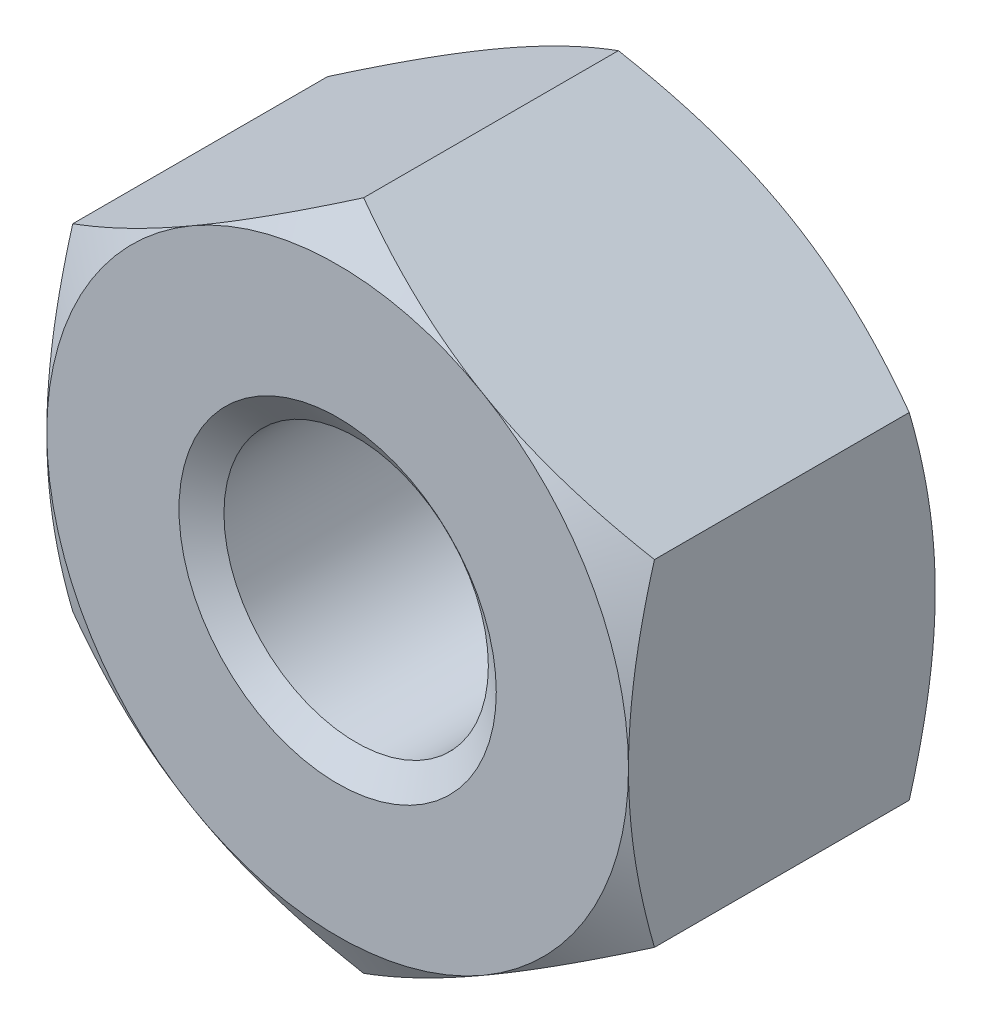
ISO-10303-21;
HEADER;
FILE_DESCRIPTION(('STEP AP214'),'2;1');
FILE_NAME('part.step','',(''),(''),'','','');
FILE_SCHEMA(('AUTOMOTIVE_DESIGN { 1 0 10303 214 1 1 1 1 }'));
ENDSEC;
DATA;
#1=APPLICATION_CONTEXT('core data for automotive mechanical design processes');
#2=APPLICATION_PROTOCOL_DEFINITION('international standard','automotive_design',2000,#1);
#3=PRODUCT_CONTEXT('',#1,'mechanical');
#4=PRODUCT('Part','Part','',(#3));
#5=PRODUCT_RELATED_PRODUCT_CATEGORY('part','',(#4));
#6=PRODUCT_DEFINITION_FORMATION('','',#4);
#7=PRODUCT_DEFINITION_CONTEXT('part definition',#1,'design');
#8=PRODUCT_DEFINITION('design','',#6,#7);
#9=PRODUCT_DEFINITION_SHAPE('','',#8);
#10=(LENGTH_UNIT() NAMED_UNIT(*) SI_UNIT(.MILLI.,.METRE.));
#11=(NAMED_UNIT(*) PLANE_ANGLE_UNIT() SI_UNIT($,.RADIAN.));
#12=(NAMED_UNIT(*) SI_UNIT($,.STERADIAN.) SOLID_ANGLE_UNIT());
#13=UNCERTAINTY_MEASURE_WITH_UNIT(LENGTH_MEASURE(1.E-05),#10,'distance_accuracy_value','');
#14=(GEOMETRIC_REPRESENTATION_CONTEXT(3) GLOBAL_UNCERTAINTY_ASSIGNED_CONTEXT((#13)) GLOBAL_UNIT_ASSIGNED_CONTEXT((#10,
#11,#12)) REPRESENTATION_CONTEXT('',''));
#15=CARTESIAN_POINT('',(0.,0.,0.));
#16=DIRECTION('',(0.,0.,1.));
#17=DIRECTION('',(1.,0.,0.));
#18=AXIS2_PLACEMENT_3D('',#15,#16,#17);
#19=CARTESIAN_POINT('',(0.,0.,-2.9));
#20=DIRECTION('',(0.,0.,1.));
#21=DIRECTION('',(1.,0.,0.));
#22=AXIS2_PLACEMENT_3D('',#19,#20,#21);
#23=CYLINDRICAL_SURFACE('',#22,1.25);
#24=CARTESIAN_POINT('',(0.,0.,-0.175051884552436));
#25=DIRECTION('',(0.,0.,1.));
#26=DIRECTION('',(1.,0.,0.));
#27=AXIS2_PLACEMENT_3D('',#24,#25,#26);
#28=CIRCLE('',#27,1.25);
#29=CARTESIAN_POINT('',(1.25,0.,-0.175051884552436));
#30=VERTEX_POINT('',#29);
#31=EDGE_CURVE('E176',#30,#30,#28,.F.);
#32=ORIENTED_EDGE('',*,*,#31,.F.);
#33=EDGE_LOOP('',(#32));
#34=FACE_BOUND('',#33,.T.);
#35=CARTESIAN_POINT('',(0.,0.,-2.69954811544757));
#36=DIRECTION('',(0.,0.,-1.));
#37=DIRECTION('',(-1.,0.,0.));
#38=AXIS2_PLACEMENT_3D('',#35,#36,#37);
#39=CIRCLE('',#38,1.25);
#40=CARTESIAN_POINT('',(-1.25,0.,-2.69954811544757));
#41=VERTEX_POINT('',#40);
#42=EDGE_CURVE('E41',#41,#41,#39,.F.);
#43=ORIENTED_EDGE('',*,*,#42,.F.);
#44=EDGE_LOOP('',(#43));
#45=FACE_BOUND('',#44,.T.);
#46=ADVANCED_FACE('F36',(#34,#45),#23,.F.);
#47=CARTESIAN_POINT('',(0.,3.17542648054296,-2.9));
#48=DIRECTION('',(-0.500000000000008,0.866025403784434,0.));
#49=DIRECTION('',(-0.866025403784434,-0.500000000000008,0.));
#50=AXIS2_PLACEMENT_3D('',#47,#48,#49);
#51=PLANE('',#50);
#52=DIRECTION('',(0.,0.,1.));
#53=VECTOR('',#52,1.);
#54=CARTESIAN_POINT('',(-2.75,1.58771324027145,-2.9));
#55=LINE('',#54,#53);
#56=CARTESIAN_POINT('',(-2.75,1.58771324027151,-2.65437990693813));
#57=VERTEX_POINT('',#56);
#58=CARTESIAN_POINT('',(-2.75,1.58771324027145,-0.245620093061857));
#59=VERTEX_POINT('',#58);
#60=EDGE_CURVE('E166',#57,#59,#55,.T.);
#61=ORIENTED_EDGE('',*,*,#60,.T.);
#62=CARTESIAN_POINT('',(-2.7502,1.58759777021761,-0.245686763364755));
#63=CARTESIAN_POINT('',(-2.62935077934009,1.65737010029697,-0.205387662249258));
#64=CARTESIAN_POINT('',(-2.50745839737737,1.72774469983531,-0.168736902597657));
#65=CARTESIAN_POINT('',(-2.26156287327211,1.86971254687001,-0.104762182969796));
#66=CARTESIAN_POINT('',(-2.13755536142615,1.94130831721582,-0.0774608556744926));
#67=CARTESIAN_POINT('',(-1.89107720202406,2.08361254889598,-0.0349617452941124));
#68=CARTESIAN_POINT('',(-1.76864448141259,2.15429911309863,-0.0194811186224536));
#69=CARTESIAN_POINT('',(-1.52320285763109,2.29600490065922,-0.000999397369936881));
#70=CARTESIAN_POINT('',(-1.4001948467671,2.36702360884403,0.00201700053740344));
#71=CARTESIAN_POINT('',(-1.17034121338921,2.49972966594897,-0.00425314542854458));
#72=CARTESIAN_POINT('',(-1.06346120874599,2.56143686540072,-0.012000154276701));
#73=CARTESIAN_POINT('',(-0.850397532665256,2.68444923614047,-0.036555181064355));
#74=CARTESIAN_POINT('',(-0.744214598351115,2.74575398185008,-0.0533715896505715));
#75=CARTESIAN_POINT('',(-0.530711510606819,2.86902004703207,-0.0954119223459598));
#76=CARTESIAN_POINT('',(-0.423418383857147,2.93096576264319,-0.120814080687235));
#77=CARTESIAN_POINT('',(-0.210432520715949,3.05393320806135,-0.178467225839989));
#78=CARTESIAN_POINT('',(-0.104737054973347,3.11495651365997,-0.210704663298991));
#79=CARTESIAN_POINT('',(0.000200000000001419,3.1755419505968,-0.245686763364771));
#80=B_SPLINE_CURVE_WITH_KNOTS('',3,(#62,#63,#64,#65,#66,#67,#68,#69,#70,#71,#72,#73,#74,#75,#76,
#77,#78,#79),.UNSPECIFIED.,.F.,.F.,(4,2,2,2,2,2,2,2,4),(0.,0.435912828725888,0.872873557116331,
1.29901931904671,1.72464171213573,2.09526089052938,2.46622354066375,2.84541551798559,
3.22386274754526),.UNSPECIFIED.);
#81=CARTESIAN_POINT('',(-1.37500000000002,2.3815698604072,0.));
#82=VERTEX_POINT('',#81);
#83=EDGE_CURVE('E135',#59,#82,#80,.T.);
#84=ORIENTED_EDGE('',*,*,#83,.T.);
#85=CARTESIAN_POINT('',(0.,3.17542648054296,-0.245620093061873));
#86=VERTEX_POINT('',#85);
#87=EDGE_CURVE('E55',#82,#86,#80,.T.);
#88=ORIENTED_EDGE('',*,*,#87,.T.);
#89=DIRECTION('',(0.,0.,1.));
#90=VECTOR('',#89,1.);
#91=CARTESIAN_POINT('',(0.,3.17542648054296,-2.9));
#92=LINE('',#91,#90);
#93=CARTESIAN_POINT('',(0.,3.17542648054296,-2.65437990693813));
#94=VERTEX_POINT('',#93);
#95=EDGE_CURVE('E151',#94,#86,#92,.T.);
#96=ORIENTED_EDGE('',*,*,#95,.F.);
#97=CARTESIAN_POINT('',(-2.7502,1.58759777021761,-2.65431323663524));
#98=CARTESIAN_POINT('',(-2.62935077934009,1.65737010029697,-2.69461233775074));
#99=CARTESIAN_POINT('',(-2.50745839737737,1.72774469983531,-2.73126309740234));
#100=CARTESIAN_POINT('',(-2.26156287327211,1.86971254687001,-2.7952378170302));
#101=CARTESIAN_POINT('',(-2.13755536142615,1.94130831721582,-2.82253914432551));
#102=CARTESIAN_POINT('',(-1.89107720202406,2.08361254889598,-2.86503825470589));
#103=CARTESIAN_POINT('',(-1.76864448141259,2.15429911309863,-2.88051888137755));
#104=CARTESIAN_POINT('',(-1.52320285763109,2.29600490065922,-2.89900060263006));
#105=CARTESIAN_POINT('',(-1.4001948467671,2.36702360884403,-2.9020170005374));
#106=CARTESIAN_POINT('',(-1.17034121338921,2.49972966594897,-2.89574685457146));
#107=CARTESIAN_POINT('',(-1.06346120874599,2.56143686540072,-2.8879998457233));
#108=CARTESIAN_POINT('',(-0.850397532665256,2.68444923614047,-2.86344481893564));
#109=CARTESIAN_POINT('',(-0.744214598351115,2.74575398185008,-2.84662841034943));
#110=CARTESIAN_POINT('',(-0.530711510606819,2.86902004703207,-2.80458807765404));
#111=CARTESIAN_POINT('',(-0.423418383857147,2.93096576264319,-2.77918591931276));
#112=CARTESIAN_POINT('',(-0.210432520715949,3.05393320806135,-2.72153277416001));
#113=CARTESIAN_POINT('',(-0.104737054973347,3.11495651365997,-2.68929533670101));
#114=CARTESIAN_POINT('',(0.000200000000001414,3.1755419505968,-2.65431323663523));
#115=B_SPLINE_CURVE_WITH_KNOTS('',3,(#97,#98,#99,#100,#101,#102,#103,#104,#105,#106,#107,#108,
#109,#110,#111,#112,#113,#114),.UNSPECIFIED.,.F.,.F.,(4,2,2,2,2,2,2,2,4),(0.,0.435912828725888,
0.872873557116332,1.29901931904671,1.72464171213573,2.09526089052938,2.46622354066375,
2.84541551798559,3.22386274754526),.UNSPECIFIED.);
#116=CARTESIAN_POINT('',(-1.37500000000002,2.3815698604072,-2.9));
#117=VERTEX_POINT('',#116);
#118=EDGE_CURVE('E169',#117,#94,#115,.T.);
#119=ORIENTED_EDGE('',*,*,#118,.F.);
#120=EDGE_CURVE('E268',#57,#117,#115,.T.);
#121=ORIENTED_EDGE('',*,*,#120,.F.);
#122=EDGE_LOOP('',(#61,#84,#88,#96,#119,#121));
#123=FACE_BOUND('',#122,.T.);
#124=ADVANCED_FACE('F38',(#123),#51,.T.);
#125=CARTESIAN_POINT('',(2.75,1.58771324027146,-2.9));
#126=DIRECTION('',(0.500000000000008,0.866025403784434,0.));
#127=DIRECTION('',(-0.866025403784434,0.500000000000008,0.));
#128=AXIS2_PLACEMENT_3D('',#125,#126,#127);
#129=PLANE('',#128);
#130=ORIENTED_EDGE('',*,*,#95,.T.);
#131=CARTESIAN_POINT('',(-0.00019999999999841,3.1755419505968,-0.245686763364771));
#132=CARTESIAN_POINT('',(0.120649220659908,3.10576962051744,-0.205387662249272));
#133=CARTESIAN_POINT('',(0.242541602622636,3.03539502097909,-0.16873690259767));
#134=CARTESIAN_POINT('',(0.488437126727895,2.8934271739444,-0.104762182969806));
#135=CARTESIAN_POINT('',(0.612444638573857,2.82183140359859,-0.0774608556745017));
#136=CARTESIAN_POINT('',(0.858922797975946,2.67952717191843,-0.0349617452941191));
#137=CARTESIAN_POINT('',(0.981355518587419,2.60884060771578,-0.0194811186224591));
#138=CARTESIAN_POINT('',(1.22679714236892,2.46713482015519,-0.000999397369940009));
#139=CARTESIAN_POINT('',(1.34980515323291,2.39611611197038,0.00201700053740151));
#140=CARTESIAN_POINT('',(1.5796587866108,2.26341005486544,-0.00425314542854448));
#141=CARTESIAN_POINT('',(1.68653879125402,2.20170285541368,-0.0120001542766998));
#142=CARTESIAN_POINT('',(1.89960246733475,2.07869048467394,-0.0365551810643516));
#143=CARTESIAN_POINT('',(2.00578540164889,2.01738573896433,-0.0533715896505668));
#144=CARTESIAN_POINT('',(2.21928848939318,1.89411967378234,-0.0954119223459524));
#145=CARTESIAN_POINT('',(2.32658161614286,1.83217395817122,-0.120814080687227));
#146=CARTESIAN_POINT('',(2.53956747928405,1.70920651275306,-0.178467225839978));
#147=CARTESIAN_POINT('',(2.64526294502665,1.64818320715445,-0.210704663298978));
#148=CARTESIAN_POINT('',(2.7502,1.58759777021762,-0.245686763364757));
#149=B_SPLINE_CURVE_WITH_KNOTS('',3,(#131,#132,#133,#134,#135,#136,#137,#138,#139,#140,#141,
#142,#143,#144,#145,#146,#147,#148),.UNSPECIFIED.,.F.,.F.,(4,2,2,2,2,2,2,2,4),(0.,
0.435912828725892,0.872873557116339,1.29901931904672,1.72464171213575,2.09526089052939,
2.46622354066376,2.84541551798559,3.22386274754526),.UNSPECIFIED.);
#150=CARTESIAN_POINT('',(1.37500000000002,2.3815698604072,0.));
#151=VERTEX_POINT('',#150);
#152=EDGE_CURVE('E145',#86,#151,#149,.T.);
#153=ORIENTED_EDGE('',*,*,#152,.T.);
#154=CARTESIAN_POINT('',(2.75,1.58771324027151,-0.245620093061873));
#155=VERTEX_POINT('',#154);
#156=EDGE_CURVE('E62',#151,#155,#149,.T.);
#157=ORIENTED_EDGE('',*,*,#156,.T.);
#158=DIRECTION('',(0.,0.,1.));
#159=VECTOR('',#158,1.);
#160=CARTESIAN_POINT('',(2.75,1.58771324027146,-2.9));
#161=LINE('',#160,#159);
#162=CARTESIAN_POINT('',(2.75,1.58771324027151,-2.65437990693813));
#163=VERTEX_POINT('',#162);
#164=EDGE_CURVE('E144',#163,#155,#161,.T.);
#165=ORIENTED_EDGE('',*,*,#164,.F.);
#166=CARTESIAN_POINT('',(-0.00019999999999841,3.1755419505968,-2.65431323663523));
#167=CARTESIAN_POINT('',(0.120649220659908,3.10576962051744,-2.69461233775073));
#168=CARTESIAN_POINT('',(0.242541602622636,3.03539502097909,-2.73126309740233));
#169=CARTESIAN_POINT('',(0.488437126727895,2.8934271739444,-2.79523781703019));
#170=CARTESIAN_POINT('',(0.612444638573858,2.82183140359859,-2.8225391443255));
#171=CARTESIAN_POINT('',(0.858922797975946,2.67952717191843,-2.86503825470588));
#172=CARTESIAN_POINT('',(0.98135551858742,2.60884060771578,-2.88051888137754));
#173=CARTESIAN_POINT('',(1.22679714236892,2.46713482015519,-2.89900060263006));
#174=CARTESIAN_POINT('',(1.34980515323291,2.39611611197038,-2.9020170005374));
#175=CARTESIAN_POINT('',(1.5796587866108,2.26341005486544,-2.89574685457146));
#176=CARTESIAN_POINT('',(1.68653879125402,2.20170285541368,-2.8879998457233));
#177=CARTESIAN_POINT('',(1.89960246733475,2.07869048467394,-2.86344481893565));
#178=CARTESIAN_POINT('',(2.00578540164889,2.01738573896433,-2.84662841034943));
#179=CARTESIAN_POINT('',(2.21928848939318,1.89411967378234,-2.80458807765405));
#180=CARTESIAN_POINT('',(2.32658161614285,1.83217395817122,-2.77918591931277));
#181=CARTESIAN_POINT('',(2.53956747928405,1.70920651275306,-2.72153277416002));
#182=CARTESIAN_POINT('',(2.64526294502665,1.64818320715445,-2.68929533670102));
#183=CARTESIAN_POINT('',(2.7502,1.58759777021762,-2.65431323663524));
#184=B_SPLINE_CURVE_WITH_KNOTS('',3,(#166,#167,#168,#169,#170,#171,#172,#173,#174,#175,#176,
#177,#178,#179,#180,#181,#182,#183),.UNSPECIFIED.,.F.,.F.,(4,2,2,2,2,2,2,2,4),(0.,
0.435912828725892,0.872873557116339,1.29901931904672,1.72464171213575,2.09526089052939,
2.46622354066376,2.84541551798558,3.22386274754526),.UNSPECIFIED.);
#185=CARTESIAN_POINT('',(1.37500000000002,2.3815698604072,-2.9));
#186=VERTEX_POINT('',#185);
#187=EDGE_CURVE('E261',#186,#163,#184,.T.);
#188=ORIENTED_EDGE('',*,*,#187,.F.);
#189=EDGE_CURVE('E267',#94,#186,#184,.T.);
#190=ORIENTED_EDGE('',*,*,#189,.F.);
#191=EDGE_LOOP('',(#130,#153,#157,#165,#188,#190));
#192=FACE_BOUND('',#191,.T.);
#193=ADVANCED_FACE('F142',(#192),#129,.T.);
#194=CARTESIAN_POINT('',(2.75,1.58771324027146,-2.9));
#195=DIRECTION('',(-1.,0.,0.));
#196=DIRECTION('',(0.,0.,1.));
#197=AXIS2_PLACEMENT_3D('',#194,#195,#196);
#198=PLANE('',#197);
#199=CARTESIAN_POINT('',(2.75,-4.21084949309679,-1.31594843960296));
#200=CARTESIAN_POINT('',(2.75,-4.09010894214093,-1.25759993615226));
#201=CARTESIAN_POINT('',(2.75,-3.96908292065512,-1.19983146511761));
#202=CARTESIAN_POINT('',(2.75,-3.72630558284847,-1.08578603842307));
#203=CARTESIAN_POINT('',(2.75,-3.60455414536203,-1.02950934100249));
#204=CARTESIAN_POINT('',(2.75,-3.35951393034357,-0.918482443352775));
#205=CARTESIAN_POINT('',(2.75,-3.23622034236439,-0.863742821605855));
#206=CARTESIAN_POINT('',(2.75,-2.98861980138746,-0.75661477747647));
#207=CARTESIAN_POINT('',(2.75,-2.86431290161185,-0.704226232536779));
#208=CARTESIAN_POINT('',(2.75,-2.61294485887175,-0.601803572146137));
#209=CARTESIAN_POINT('',(2.75,-2.48586863815657,-0.551806257898406));
#210=CARTESIAN_POINT('',(2.75,-2.23021732171543,-0.455727408784612));
#211=CARTESIAN_POINT('',(2.75,-2.10164206103366,-0.409646309576982));
#212=CARTESIAN_POINT('',(2.75,-1.8430521879947,-0.32263807704624));
#213=CARTESIAN_POINT('',(2.75,-1.71304130052586,-0.281699986413896));
#214=CARTESIAN_POINT('',(2.75,-1.4511712506215,-0.206307307624354));
#215=CARTESIAN_POINT('',(2.75,-1.31931268690205,-0.171850669152772));
#216=CARTESIAN_POINT('',(2.75,-1.05365722480015,-0.111093671530907));
#217=CARTESIAN_POINT('',(2.75,-0.919859820217614,-0.084795484095124));
#218=CARTESIAN_POINT('',(2.75,-0.650651874037403,-0.0421260371966123));
#219=CARTESIAN_POINT('',(2.75,-0.515241331013616,-0.0257547865105436));
#220=CARTESIAN_POINT('',(2.75,-0.244373242869231,-0.00438749654023665));
#221=CARTESIAN_POINT('',(2.75,-0.108921526377152,0.000680556773217393));
#222=CARTESIAN_POINT('',(2.75,0.161887058855116,-0.000827795632669437));
#223=CARTESIAN_POINT('',(2.75,0.297243943089623,-0.00740117868555063));
#224=CARTESIAN_POINT('',(2.75,0.528385436717524,-0.02810413004684));
#225=CARTESIAN_POINT('',(2.75,0.62442505013748,-0.039537641030184));
#226=CARTESIAN_POINT('',(2.75,0.81576239981152,-0.0675217196133457));
#227=CARTESIAN_POINT('',(2.75,0.911060016631941,-0.0840730942276763));
#228=CARTESIAN_POINT('',(2.75,1.19576218748914,-0.140535361278277));
#229=CARTESIAN_POINT('',(2.75,1.38383224738493,-0.187239859417285));
#230=CARTESIAN_POINT('',(2.75,1.66525048947482,-0.267792497030568));
#231=CARTESIAN_POINT('',(2.75,1.76006556248554,-0.296803334995489));
#232=CARTESIAN_POINT('',(2.75,1.94870609382211,-0.357695648906575));
#233=CARTESIAN_POINT('',(2.75,2.04253218553692,-0.38957514487849));
#234=CARTESIAN_POINT('',(2.75,2.2288024035498,-0.455541418186434));
#235=CARTESIAN_POINT('',(2.75,2.32125133588447,-0.489614761455518));
#236=CARTESIAN_POINT('',(2.75,2.50543192042624,-0.559761368231093));
#237=CARTESIAN_POINT('',(2.75,2.59716326539574,-0.595835440037301));
#238=CARTESIAN_POINT('',(2.75,2.68856293053341,-0.632712441997467));
#239=B_SPLINE_CURVE_WITH_KNOTS('',3,(#199,#200,#201,#202,#203,#204,#205,#206,#207,#208,#209,
#210,#211,#212,#213,#214,#215,#216,#217,#218,#219,#220,#221,#222,#223,#224,#225,#226,#227,#228,
#229,#230,#231,#232,#233,#234,#235,#236,#237,#238),.UNSPECIFIED.,.F.,.F.,(4,2,2,2,2,2,2,2,2,2,2,
2,2,2,2,2,2,2,2,4),(0.,0.402305607365937,0.804680408536998,1.20935783819118,1.61401414820819,
2.0236383818577,2.43330812457349,2.84208969479601,3.25074173456637,3.65950246109145,
4.06826354901185,4.47441284024652,4.88045669141174,5.17046846817547,5.46052599902453,
6.04107275309883,6.33851131304661,6.63574613017454,6.93130791005791,7.22698998004821),.UNSPECIFIED.);
#240=CARTESIAN_POINT('',(2.75000000000001,-1.58771324027149,-0.245620093061873));
#241=VERTEX_POINT('',#240);
#242=CARTESIAN_POINT('',(2.75,0.,0.));
#243=VERTEX_POINT('',#242);
#244=EDGE_CURVE('E137',#241,#243,#239,.T.);
#245=ORIENTED_EDGE('',*,*,#244,.F.);
#246=DIRECTION('',(0.,0.,1.));
#247=VECTOR('',#246,1.);
#248=CARTESIAN_POINT('',(2.75,-1.5877132402715,-2.9));
#249=LINE('',#248,#247);
#250=CARTESIAN_POINT('',(2.75000000000001,-1.58771324027149,-2.65437990693813));
#251=VERTEX_POINT('',#250);
#252=EDGE_CURVE('E152',#251,#241,#249,.T.);
#253=ORIENTED_EDGE('',*,*,#252,.F.);
#254=CARTESIAN_POINT('',(2.75,-4.21084949309679,-1.58405156039704));
#255=CARTESIAN_POINT('',(2.75,-4.09010894214093,-1.64240006384774));
#256=CARTESIAN_POINT('',(2.75,-3.96908292065512,-1.70016853488239));
#257=CARTESIAN_POINT('',(2.75,-3.72630558284846,-1.81421396157693));
#258=CARTESIAN_POINT('',(2.75,-3.60455414536203,-1.87049065899751));
#259=CARTESIAN_POINT('',(2.75,-3.35951393034357,-1.98151755664723));
#260=CARTESIAN_POINT('',(2.75,-3.23622034236439,-2.03625717839415));
#261=CARTESIAN_POINT('',(2.75,-2.98861980138746,-2.14338522252353));
#262=CARTESIAN_POINT('',(2.75,-2.86431290161185,-2.19577376746322));
#263=CARTESIAN_POINT('',(2.75,-2.61294485887175,-2.29819642785386));
#264=CARTESIAN_POINT('',(2.75,-2.48586863815657,-2.34819374210159));
#265=CARTESIAN_POINT('',(2.75,-2.23021732171543,-2.44427259121539));
#266=CARTESIAN_POINT('',(2.75,-2.10164206103366,-2.49035369042302));
#267=CARTESIAN_POINT('',(2.75,-1.8430521879947,-2.57736192295376));
#268=CARTESIAN_POINT('',(2.75,-1.71304130052586,-2.6183000135861));
#269=CARTESIAN_POINT('',(2.75,-1.4511712506215,-2.69369269237565));
#270=CARTESIAN_POINT('',(2.75,-1.31931268690205,-2.72814933084723));
#271=CARTESIAN_POINT('',(2.75,-1.05365722480015,-2.78890632846909));
#272=CARTESIAN_POINT('',(2.75,-0.919859820217613,-2.81520451590488));
#273=CARTESIAN_POINT('',(2.75,-0.650651874037402,-2.85787396280339));
#274=CARTESIAN_POINT('',(2.75,-0.515241331013616,-2.87424521348946));
#275=CARTESIAN_POINT('',(2.75,-0.244373242869231,-2.89561250345976));
#276=CARTESIAN_POINT('',(2.75,-0.108921526377152,-2.90068055677322));
#277=CARTESIAN_POINT('',(2.75,0.161887058855116,-2.89917220436733));
#278=CARTESIAN_POINT('',(2.75,0.297243943089623,-2.89259882131445));
#279=CARTESIAN_POINT('',(2.75,0.528385436717523,-2.87189586995316));
#280=CARTESIAN_POINT('',(2.75,0.62442505013748,-2.86046235896982));
#281=CARTESIAN_POINT('',(2.75,0.81576239981152,-2.83247828038665));
#282=CARTESIAN_POINT('',(2.75,0.911060016631941,-2.81592690577232));
#283=CARTESIAN_POINT('',(2.75,1.19576218748914,-2.75946463872172));
#284=CARTESIAN_POINT('',(2.75,1.38383224738493,-2.71276014058271));
#285=CARTESIAN_POINT('',(2.75,1.66525048947482,-2.63220750296943));
#286=CARTESIAN_POINT('',(2.75,1.76006556248554,-2.60319666500451));
#287=CARTESIAN_POINT('',(2.75,1.94870609382211,-2.54230435109342));
#288=CARTESIAN_POINT('',(2.75,2.04253218553692,-2.51042485512151));
#289=CARTESIAN_POINT('',(2.75,2.2288024035498,-2.44445858181357));
#290=CARTESIAN_POINT('',(2.75,2.32125133588447,-2.41038523854448));
#291=CARTESIAN_POINT('',(2.75,2.50543192042624,-2.34023863176891));
#292=CARTESIAN_POINT('',(2.75,2.59716326539574,-2.3041645599627));
#293=CARTESIAN_POINT('',(2.75,2.68856293053341,-2.26728755800253));
#294=B_SPLINE_CURVE_WITH_KNOTS('',3,(#254,#255,#256,#257,#258,#259,#260,#261,#262,#263,#264,
#265,#266,#267,#268,#269,#270,#271,#272,#273,#274,#275,#276,#277,#278,#279,#280,#281,#282,#283,
#284,#285,#286,#287,#288,#289,#290,#291,#292,#293),.UNSPECIFIED.,.F.,.F.,(4,2,2,2,2,2,2,2,2,2,2,
2,2,2,2,2,2,2,2,4),(0.,0.402305607365938,0.804680408536999,1.20935783819118,1.61401414820819,
2.0236383818577,2.43330812457349,2.84208969479601,3.25074173456637,3.65950246109145,
4.06826354901185,4.47441284024652,4.88045669141174,5.17046846817547,5.46052599902453,
6.04107275309883,6.33851131304661,6.63574613017454,6.93130791005791,7.22698998004821),.UNSPECIFIED.);
#295=CARTESIAN_POINT('',(2.75,0.,-2.9));
#296=VERTEX_POINT('',#295);
#297=EDGE_CURVE('E275',#251,#296,#294,.T.);
#298=ORIENTED_EDGE('',*,*,#297,.T.);
#299=EDGE_CURVE('E150',#296,#163,#294,.T.);
#300=ORIENTED_EDGE('',*,*,#299,.T.);
#301=ORIENTED_EDGE('',*,*,#164,.T.);
#302=EDGE_CURVE('E127',#243,#155,#239,.T.);
#303=ORIENTED_EDGE('',*,*,#302,.F.);
#304=EDGE_LOOP('',(#245,#253,#298,#300,#301,#303));
#305=FACE_BOUND('',#304,.T.);
#306=ADVANCED_FACE('F148',(#305),#198,.F.);
#307=CARTESIAN_POINT('',(0.,-3.175426480543,-2.9));
#308=DIRECTION('',(0.500000000000007,-0.866025403784435,0.));
#309=DIRECTION('',(0.866025403784435,0.500000000000007,0.));
#310=AXIS2_PLACEMENT_3D('',#307,#308,#309);
#311=PLANE('',#310);
#312=ORIENTED_EDGE('',*,*,#252,.T.);
#313=CARTESIAN_POINT('',(2.7502,-1.58759777021766,-0.245686763364769));
#314=CARTESIAN_POINT('',(2.62935077934009,-1.65737010029702,-0.205387662249272));
#315=CARTESIAN_POINT('',(2.50745839737736,-1.72774469983536,-0.168736902597671));
#316=CARTESIAN_POINT('',(2.2615628732721,-1.86971254687006,-0.104762182969811));
#317=CARTESIAN_POINT('',(2.13755536142614,-1.94130831721586,-0.0774608556745088));
#318=CARTESIAN_POINT('',(1.89107720202405,-2.08361254889603,-0.0349617452941302));
#319=CARTESIAN_POINT('',(1.76864448141258,-2.15429911309868,-0.0194811186224723));
#320=CARTESIAN_POINT('',(1.52320285763108,-2.29600490065927,-0.000999397369957487));
#321=CARTESIAN_POINT('',(1.40019484676708,-2.36702360884408,0.00201700053738184));
#322=CARTESIAN_POINT('',(1.1703412133892,-2.49972966594902,-0.00425314542856775));
#323=CARTESIAN_POINT('',(1.06346120874597,-2.56143686540077,-0.0120001542767246));
#324=CARTESIAN_POINT('',(0.850397532665247,-2.68444923614051,-0.0365551810643794));
#325=CARTESIAN_POINT('',(0.744214598351108,-2.74575398185013,-0.0533715896505962));
#326=CARTESIAN_POINT('',(0.530711510606814,-2.86902004703211,-0.0954119223459845));
#327=CARTESIAN_POINT('',(0.423418383857143,-2.93096576264323,-0.12081408068726));
#328=CARTESIAN_POINT('',(0.210432520715948,-3.05393320806139,-0.178467225840013));
#329=CARTESIAN_POINT('',(0.104737054973348,-3.11495651366001,-0.210704663299014));
#330=CARTESIAN_POINT('',(-0.000199999999998988,-3.17554195059683,-0.245686763364793));
#331=B_SPLINE_CURVE_WITH_KNOTS('',3,(#313,#314,#315,#316,#317,#318,#319,#320,#321,#322,#323,
#324,#325,#326,#327,#328,#329,#330),.UNSPECIFIED.,.F.,.F.,(4,2,2,2,2,2,2,2,4),(0.,
0.435912828725891,0.872873557116337,1.29901931904672,1.72464171213575,2.09526089052939,
2.46622354066375,2.84541551798558,3.22386274754526),.UNSPECIFIED.);
#332=CARTESIAN_POINT('',(1.37500000000002,-2.3815698604072,0.));
#333=VERTEX_POINT('',#332);
#334=EDGE_CURVE('E373',#241,#333,#331,.T.);
#335=ORIENTED_EDGE('',*,*,#334,.T.);
#336=CARTESIAN_POINT('',(0.,-3.17542648054296,-0.245620093061873));
#337=VERTEX_POINT('',#336);
#338=EDGE_CURVE('E229',#333,#337,#331,.T.);
#339=ORIENTED_EDGE('',*,*,#338,.T.);
#340=DIRECTION('',(0.,0.,1.));
#341=VECTOR('',#340,1.);
#342=CARTESIAN_POINT('',(0.,-3.175426480543,-2.9));
#343=LINE('',#342,#341);
#344=CARTESIAN_POINT('',(0.,-3.17542648054296,-2.65437990693813));
#345=VERTEX_POINT('',#344);
#346=EDGE_CURVE('E157',#345,#337,#343,.T.);
#347=ORIENTED_EDGE('',*,*,#346,.F.);
#348=CARTESIAN_POINT('',(2.7502,-1.58759777021766,-2.65431323663523));
#349=CARTESIAN_POINT('',(2.62935077934009,-1.65737010029702,-2.69461233775073));
#350=CARTESIAN_POINT('',(2.50745839737736,-1.72774469983536,-2.73126309740233));
#351=CARTESIAN_POINT('',(2.2615628732721,-1.86971254687006,-2.79523781703019));
#352=CARTESIAN_POINT('',(2.13755536142614,-1.94130831721586,-2.82253914432549));
#353=CARTESIAN_POINT('',(1.89107720202405,-2.08361254889603,-2.86503825470587));
#354=CARTESIAN_POINT('',(1.76864448141258,-2.15429911309868,-2.88051888137753));
#355=CARTESIAN_POINT('',(1.52320285763108,-2.29600490065927,-2.89900060263004));
#356=CARTESIAN_POINT('',(1.40019484676708,-2.36702360884408,-2.90201700053738));
#357=CARTESIAN_POINT('',(1.1703412133892,-2.49972966594902,-2.89574685457143));
#358=CARTESIAN_POINT('',(1.06346120874597,-2.56143686540077,-2.88799984572328));
#359=CARTESIAN_POINT('',(0.850397532665247,-2.68444923614051,-2.86344481893562));
#360=CARTESIAN_POINT('',(0.744214598351108,-2.74575398185013,-2.8466284103494));
#361=CARTESIAN_POINT('',(0.530711510606815,-2.86902004703211,-2.80458807765402));
#362=CARTESIAN_POINT('',(0.423418383857144,-2.93096576264323,-2.77918591931274));
#363=CARTESIAN_POINT('',(0.210432520715949,-3.05393320806139,-2.72153277415999));
#364=CARTESIAN_POINT('',(0.104737054973348,-3.11495651366,-2.68929533670099));
#365=CARTESIAN_POINT('',(-0.000199999999998861,-3.17554195059683,-2.65431323663521));
#366=B_SPLINE_CURVE_WITH_KNOTS('',3,(#348,#349,#350,#351,#352,#353,#354,#355,#356,#357,#358,
#359,#360,#361,#362,#363,#364,#365),.UNSPECIFIED.,.F.,.F.,(4,2,2,2,2,2,2,2,4),(0.,
0.435912828725891,0.872873557116338,1.29901931904672,1.72464171213575,2.09526089052939,
2.46622354066375,2.84541551798558,3.22386274754526),.UNSPECIFIED.);
#367=CARTESIAN_POINT('',(1.37500000000002,-2.3815698604072,-2.9));
#368=VERTEX_POINT('',#367);
#369=EDGE_CURVE('E282',#368,#345,#366,.T.);
#370=ORIENTED_EDGE('',*,*,#369,.F.);
#371=EDGE_CURVE('E281',#251,#368,#366,.T.);
#372=ORIENTED_EDGE('',*,*,#371,.F.);
#373=EDGE_LOOP('',(#312,#335,#339,#347,#370,#372));
#374=FACE_BOUND('',#373,.T.);
#375=ADVANCED_FACE('F294',(#374),#311,.T.);
#376=CARTESIAN_POINT('',(-2.75,-1.5877132402715,-2.9));
#377=DIRECTION('',(-0.500000000000006,-0.866025403784435,0.));
#378=DIRECTION('',(0.866025403784435,-0.500000000000006,0.));
#379=AXIS2_PLACEMENT_3D('',#376,#377,#378);
#380=PLANE('',#379);
#381=ORIENTED_EDGE('',*,*,#346,.T.);
#382=CARTESIAN_POINT('',(0.000200000000001002,-3.17554195059683,-0.245686763364793));
#383=CARTESIAN_POINT('',(-0.120649220659907,-3.10576962051748,-0.205387662249294));
#384=CARTESIAN_POINT('',(-0.242541602622636,-3.03539502097913,-0.168736902597691));
#385=CARTESIAN_POINT('',(-0.488437126727898,-2.89342717394443,-0.104762182969827));
#386=CARTESIAN_POINT('',(-0.612444638573863,-2.82183140359863,-0.0774608556745226));
#387=CARTESIAN_POINT('',(-0.858922797975955,-2.67952717191846,-0.0349617452941396));
#388=CARTESIAN_POINT('',(-0.98135551858743,-2.60884060771581,-0.0194811186224794));
#389=CARTESIAN_POINT('',(-1.22679714236893,-2.46713482015522,-0.000999397369960387));
#390=CARTESIAN_POINT('',(-1.34980515323293,-2.39611611197041,0.00201700053738092));
#391=CARTESIAN_POINT('',(-1.57965878661081,-2.26341005486547,-0.00425314542856523));
#392=CARTESIAN_POINT('',(-1.68653879125404,-2.20170285541372,-0.0120001542767203));
#393=CARTESIAN_POINT('',(-1.89960246733476,-2.07869048467398,-0.0365551810643714));
#394=CARTESIAN_POINT('',(-2.0057854016489,-2.01738573896436,-0.0533715896505862));
#395=CARTESIAN_POINT('',(-2.21928848939319,-1.89411967378238,-0.0954119223459706));
#396=CARTESIAN_POINT('',(-2.32658161614286,-1.83217395817126,-0.120814080687244));
#397=CARTESIAN_POINT('',(-2.53956747928405,-1.70920651275311,-0.178467225839993));
#398=CARTESIAN_POINT('',(-2.64526294502665,-1.64818320715449,-0.210704663298993));
#399=CARTESIAN_POINT('',(-2.7502,-1.58759777021766,-0.24568676336477));
#400=B_SPLINE_CURVE_WITH_KNOTS('',3,(#382,#383,#384,#385,#386,#387,#388,#389,#390,#391,#392,
#393,#394,#395,#396,#397,#398,#399),.UNSPECIFIED.,.F.,.F.,(4,2,2,2,2,2,2,2,4),(0.,
0.435912828725896,0.872873557116349,1.29901931904674,1.72464171213577,2.0952608905294,
2.46622354066377,2.84541551798559,3.22386274754526),.UNSPECIFIED.);
#401=CARTESIAN_POINT('',(-1.37500000000002,-2.3815698604072,0.));
#402=VERTEX_POINT('',#401);
#403=EDGE_CURVE('E370',#337,#402,#400,.T.);
#404=ORIENTED_EDGE('',*,*,#403,.T.);
#405=CARTESIAN_POINT('',(-2.75,-1.58771324027151,-0.245620093061873));
#406=VERTEX_POINT('',#405);
#407=EDGE_CURVE('E202',#402,#406,#400,.T.);
#408=ORIENTED_EDGE('',*,*,#407,.T.);
#409=DIRECTION('',(0.,0.,1.));
#410=VECTOR('',#409,1.);
#411=CARTESIAN_POINT('',(-2.75,-1.5877132402715,-2.9));
#412=LINE('',#411,#410);
#413=CARTESIAN_POINT('',(-2.75,-1.58771324027151,-2.65437990693813));
#414=VERTEX_POINT('',#413);
#415=EDGE_CURVE('E163',#414,#406,#412,.T.);
#416=ORIENTED_EDGE('',*,*,#415,.F.);
#417=CARTESIAN_POINT('',(0.000200000000001002,-3.17554195059683,-2.65431323663521));
#418=CARTESIAN_POINT('',(-0.120649220659907,-3.10576962051748,-2.69461233775071));
#419=CARTESIAN_POINT('',(-0.242541602622636,-3.03539502097913,-2.73126309740231));
#420=CARTESIAN_POINT('',(-0.488437126727899,-2.89342717394443,-2.79523781703017));
#421=CARTESIAN_POINT('',(-0.612444638573863,-2.82183140359863,-2.82253914432548));
#422=CARTESIAN_POINT('',(-0.858922797975955,-2.67952717191846,-2.86503825470586));
#423=CARTESIAN_POINT('',(-0.98135551858743,-2.60884060771581,-2.88051888137752));
#424=CARTESIAN_POINT('',(-1.22679714236893,-2.46713482015522,-2.89900060263004));
#425=CARTESIAN_POINT('',(-1.34980515323293,-2.39611611197041,-2.90201700053738));
#426=CARTESIAN_POINT('',(-1.57965878661081,-2.26341005486547,-2.89574685457143));
#427=CARTESIAN_POINT('',(-1.68653879125404,-2.20170285541372,-2.88799984572328));
#428=CARTESIAN_POINT('',(-1.89960246733476,-2.07869048467398,-2.86344481893563));
#429=CARTESIAN_POINT('',(-2.0057854016489,-2.01738573896436,-2.84662841034941));
#430=CARTESIAN_POINT('',(-2.21928848939319,-1.89411967378238,-2.80458807765403));
#431=CARTESIAN_POINT('',(-2.32658161614286,-1.83217395817126,-2.77918591931276));
#432=CARTESIAN_POINT('',(-2.53956747928405,-1.70920651275311,-2.72153277416001));
#433=CARTESIAN_POINT('',(-2.64526294502665,-1.64818320715449,-2.68929533670101));
#434=CARTESIAN_POINT('',(-2.7502,-1.58759777021766,-2.65431323663523));
#435=B_SPLINE_CURVE_WITH_KNOTS('',3,(#417,#418,#419,#420,#421,#422,#423,#424,#425,#426,#427,
#428,#429,#430,#431,#432,#433,#434),.UNSPECIFIED.,.F.,.F.,(4,2,2,2,2,2,2,2,4),(0.,
0.435912828725897,0.872873557116349,1.29901931904674,1.72464171213577,2.0952608905294,
2.46622354066377,2.84541551798559,3.22386274754526),.UNSPECIFIED.);
#436=CARTESIAN_POINT('',(-1.37500000000002,-2.3815698604072,-2.9));
#437=VERTEX_POINT('',#436);
#438=EDGE_CURVE('E289',#437,#414,#435,.T.);
#439=ORIENTED_EDGE('',*,*,#438,.F.);
#440=EDGE_CURVE('E288',#345,#437,#435,.T.);
#441=ORIENTED_EDGE('',*,*,#440,.F.);
#442=EDGE_LOOP('',(#381,#404,#408,#416,#439,#441));
#443=FACE_BOUND('',#442,.T.);
#444=ADVANCED_FACE('F297',(#443),#380,.T.);
#445=CARTESIAN_POINT('',(-2.75,1.58771324027145,-2.9));
#446=DIRECTION('',(-1.,0.,0.));
#447=DIRECTION('',(0.,0.,1.));
#448=AXIS2_PLACEMENT_3D('',#445,#446,#447);
#449=PLANE('',#448);
#450=ORIENTED_EDGE('',*,*,#415,.T.);
#451=CARTESIAN_POINT('',(-2.75,-4.21084949309679,-1.31594843960296));
#452=CARTESIAN_POINT('',(-2.75,-4.09010894214093,-1.25759993615227));
#453=CARTESIAN_POINT('',(-2.75,-3.96908292065512,-1.19983146511761));
#454=CARTESIAN_POINT('',(-2.75,-3.72630558284847,-1.08578603842307));
#455=CARTESIAN_POINT('',(-2.75,-3.60455414536203,-1.02950934100249));
#456=CARTESIAN_POINT('',(-2.75,-3.35951393034358,-0.918482443352777));
#457=CARTESIAN_POINT('',(-2.75,-3.2362203423644,-0.863742821605856));
#458=CARTESIAN_POINT('',(-2.75,-2.98861980138747,-0.756614777476471));
#459=CARTESIAN_POINT('',(-2.75,-2.86431290161185,-0.70422623253678));
#460=CARTESIAN_POINT('',(-2.75,-2.61294485887175,-0.601803572146139));
#461=CARTESIAN_POINT('',(-2.75,-2.48586863815657,-0.551806257898408));
#462=CARTESIAN_POINT('',(-2.75,-2.23021732171544,-0.455727408784613));
#463=CARTESIAN_POINT('',(-2.75,-2.10164206103366,-0.409646309576983));
#464=CARTESIAN_POINT('',(-2.75,-1.8430521879947,-0.322638077046241));
#465=CARTESIAN_POINT('',(-2.75,-1.71304130052586,-0.281699986413897));
#466=CARTESIAN_POINT('',(-2.75,-1.4511712506215,-0.206307307624355));
#467=CARTESIAN_POINT('',(-2.75,-1.31931268690205,-0.171850669152773));
#468=CARTESIAN_POINT('',(-2.75,-1.05365722480015,-0.111093671530908));
#469=CARTESIAN_POINT('',(-2.75,-0.919859820217618,-0.0847954840951249));
#470=CARTESIAN_POINT('',(-2.75,-0.650651874037407,-0.0421260371966128));
#471=CARTESIAN_POINT('',(-2.75,-0.51524133101362,-0.0257547865105438));
#472=CARTESIAN_POINT('',(-2.75,-0.244373242869235,-0.00438749654023648));
#473=CARTESIAN_POINT('',(-2.75,-0.108921526377157,0.00068055677321763));
#474=CARTESIAN_POINT('',(-2.75,0.161887058855112,-0.000827795632669175));
#475=CARTESIAN_POINT('',(-2.75,0.297243943089619,-0.00740117868555047));
#476=CARTESIAN_POINT('',(-2.75,0.52838543671752,-0.0281041300468396));
#477=CARTESIAN_POINT('',(-2.75,0.624425050137476,-0.0395376410301834));
#478=CARTESIAN_POINT('',(-2.75,0.815762399811516,-0.0675217196133449));
#479=CARTESIAN_POINT('',(-2.75,0.911060016631937,-0.0840730942276756));
#480=CARTESIAN_POINT('',(-2.75,1.19576218748913,-0.140535361278276));
#481=CARTESIAN_POINT('',(-2.75,1.38383224738493,-0.187239859417283));
#482=CARTESIAN_POINT('',(-2.75,1.66525048947481,-0.267792497030566));
#483=CARTESIAN_POINT('',(-2.75,1.76006556248554,-0.296803334995488));
#484=CARTESIAN_POINT('',(-2.75,1.94870609382211,-0.357695648906574));
#485=CARTESIAN_POINT('',(-2.75,2.04253218553691,-0.389575144878489));
#486=CARTESIAN_POINT('',(-2.75,2.2288024035498,-0.455541418186432));
#487=CARTESIAN_POINT('',(-2.75,2.32125133588446,-0.489614761455516));
#488=CARTESIAN_POINT('',(-2.75,2.50543192042623,-0.559761368231091));
#489=CARTESIAN_POINT('',(-2.75,2.59716326539574,-0.595835440037299));
#490=CARTESIAN_POINT('',(-2.75,2.6885629305334,-0.632712441997465));
#491=B_SPLINE_CURVE_WITH_KNOTS('',3,(#451,#452,#453,#454,#455,#456,#457,#458,#459,#460,#461,
#462,#463,#464,#465,#466,#467,#468,#469,#470,#471,#472,#473,#474,#475,#476,#477,#478,#479,#480,
#481,#482,#483,#484,#485,#486,#487,#488,#489,#490),.UNSPECIFIED.,.F.,.F.,(4,2,2,2,2,2,2,2,2,2,2,
2,2,2,2,2,2,2,2,4),(0.,0.402305607365937,0.804680408536999,1.20935783819118,1.61401414820819,
2.0236383818577,2.43330812457349,2.84208969479601,3.25074173456637,3.65950246109145,
4.06826354901185,4.47441284024652,4.88045669141174,5.17046846817547,5.46052599902453,
6.04107275309883,6.33851131304661,6.63574613017454,6.93130791005791,7.22698998004821),.UNSPECIFIED.);
#492=CARTESIAN_POINT('',(-2.75,0.,0.));
#493=VERTEX_POINT('',#492);
#494=EDGE_CURVE('E201',#406,#493,#491,.T.);
#495=ORIENTED_EDGE('',*,*,#494,.T.);
#496=EDGE_CURVE('E193',#493,#59,#491,.T.);
#497=ORIENTED_EDGE('',*,*,#496,.T.);
#498=ORIENTED_EDGE('',*,*,#60,.F.);
#499=CARTESIAN_POINT('',(-2.75,-4.21084949309679,-1.58405156039704));
#500=CARTESIAN_POINT('',(-2.75,-4.09010894214093,-1.64240006384773));
#501=CARTESIAN_POINT('',(-2.75,-3.96908292065512,-1.70016853488239));
#502=CARTESIAN_POINT('',(-2.75,-3.72630558284847,-1.81421396157693));
#503=CARTESIAN_POINT('',(-2.75,-3.60455414536203,-1.87049065899751));
#504=CARTESIAN_POINT('',(-2.75,-3.35951393034358,-1.98151755664722));
#505=CARTESIAN_POINT('',(-2.75,-3.2362203423644,-2.03625717839414));
#506=CARTESIAN_POINT('',(-2.75,-2.98861980138747,-2.14338522252353));
#507=CARTESIAN_POINT('',(-2.75,-2.86431290161185,-2.19577376746322));
#508=CARTESIAN_POINT('',(-2.75,-2.61294485887175,-2.29819642785386));
#509=CARTESIAN_POINT('',(-2.75,-2.48586863815657,-2.34819374210159));
#510=CARTESIAN_POINT('',(-2.75,-2.23021732171544,-2.44427259121539));
#511=CARTESIAN_POINT('',(-2.75,-2.10164206103366,-2.49035369042302));
#512=CARTESIAN_POINT('',(-2.75,-1.8430521879947,-2.57736192295376));
#513=CARTESIAN_POINT('',(-2.75,-1.71304130052586,-2.6183000135861));
#514=CARTESIAN_POINT('',(-2.75,-1.4511712506215,-2.69369269237564));
#515=CARTESIAN_POINT('',(-2.75,-1.31931268690205,-2.72814933084723));
#516=CARTESIAN_POINT('',(-2.75,-1.05365722480015,-2.78890632846909));
#517=CARTESIAN_POINT('',(-2.75,-0.919859820217618,-2.81520451590488));
#518=CARTESIAN_POINT('',(-2.75,-0.650651874037407,-2.85787396280339));
#519=CARTESIAN_POINT('',(-2.75,-0.51524133101362,-2.87424521348946));
#520=CARTESIAN_POINT('',(-2.75,-0.244373242869234,-2.89561250345976));
#521=CARTESIAN_POINT('',(-2.75,-0.108921526377156,-2.90068055677322));
#522=CARTESIAN_POINT('',(-2.75,0.161887058855113,-2.89917220436733));
#523=CARTESIAN_POINT('',(-2.75,0.297243943089619,-2.89259882131445));
#524=CARTESIAN_POINT('',(-2.75,0.52838543671752,-2.87189586995316));
#525=CARTESIAN_POINT('',(-2.75,0.624425050137477,-2.86046235896982));
#526=CARTESIAN_POINT('',(-2.75,0.815762399811517,-2.83247828038665));
#527=CARTESIAN_POINT('',(-2.75,0.911060016631938,-2.81592690577232));
#528=CARTESIAN_POINT('',(-2.75,1.19576218748913,-2.75946463872172));
#529=CARTESIAN_POINT('',(-2.75,1.38383224738493,-2.71276014058272));
#530=CARTESIAN_POINT('',(-2.75,1.66525048947481,-2.63220750296943));
#531=CARTESIAN_POINT('',(-2.75,1.76006556248554,-2.60319666500451));
#532=CARTESIAN_POINT('',(-2.75,1.94870609382211,-2.54230435109343));
#533=CARTESIAN_POINT('',(-2.75,2.04253218553691,-2.51042485512151));
#534=CARTESIAN_POINT('',(-2.75,2.2288024035498,-2.44445858181357));
#535=CARTESIAN_POINT('',(-2.75,2.32125133588446,-2.41038523854448));
#536=CARTESIAN_POINT('',(-2.75,2.50543192042623,-2.34023863176891));
#537=CARTESIAN_POINT('',(-2.75,2.59716326539574,-2.3041645599627));
#538=CARTESIAN_POINT('',(-2.75,2.6885629305334,-2.26728755800254));
#539=B_SPLINE_CURVE_WITH_KNOTS('',3,(#499,#500,#501,#502,#503,#504,#505,#506,#507,#508,#509,
#510,#511,#512,#513,#514,#515,#516,#517,#518,#519,#520,#521,#522,#523,#524,#525,#526,#527,#528,
#529,#530,#531,#532,#533,#534,#535,#536,#537,#538),.UNSPECIFIED.,.F.,.F.,(4,2,2,2,2,2,2,2,2,2,2,
2,2,2,2,2,2,2,2,4),(0.,0.402305607365937,0.804680408536999,1.20935783819118,1.61401414820819,
2.0236383818577,2.43330812457349,2.84208969479601,3.25074173456637,3.65950246109145,
4.06826354901185,4.47441284024652,4.88045669141174,5.17046846817547,5.46052599902453,
6.04107275309883,6.33851131304661,6.63574613017454,6.93130791005791,7.22698998004821),.UNSPECIFIED.);
#540=CARTESIAN_POINT('',(-2.75,0.,-2.9));
#541=VERTEX_POINT('',#540);
#542=EDGE_CURVE('E341',#541,#57,#539,.T.);
#543=ORIENTED_EDGE('',*,*,#542,.F.);
#544=EDGE_CURVE('E344',#414,#541,#539,.T.);
#545=ORIENTED_EDGE('',*,*,#544,.F.);
#546=EDGE_LOOP('',(#450,#495,#497,#498,#543,#545));
#547=FACE_BOUND('',#546,.T.);
#548=ADVANCED_FACE('F209',(#547),#449,.T.);
#549=CARTESIAN_POINT('',(0.,3.17542648054296,0.));
#550=DIRECTION('',(0.,0.,-1.));
#551=DIRECTION('',(-1.,0.,0.));
#552=AXIS2_PLACEMENT_3D('',#549,#550,#551);
#553=PLANE('',#552);
#554=CARTESIAN_POINT('',(0.,0.,0.));
#555=DIRECTION('',(0.,0.,1.));
#556=DIRECTION('',(1.,0.,0.));
#557=AXIS2_PLACEMENT_3D('',#554,#555,#556);
#558=CIRCLE('',#557,1.5);
#559=CARTESIAN_POINT('',(1.5,0.,0.));
#560=VERTEX_POINT('',#559);
#561=EDGE_CURVE('E178',#560,#560,#558,.T.);
#562=ORIENTED_EDGE('',*,*,#561,.F.);
#563=EDGE_LOOP('',(#562));
#564=FACE_BOUND('',#563,.T.);
#565=CARTESIAN_POINT('',(0.,0.,0.));
#566=DIRECTION('',(0.,0.,-1.));
#567=DIRECTION('',(-1.,0.,0.));
#568=AXIS2_PLACEMENT_3D('',#565,#566,#567);
#569=CIRCLE('',#568,2.75);
#570=EDGE_CURVE('E11',#493,#82,#569,.T.);
#571=ORIENTED_EDGE('',*,*,#570,.F.);
#572=EDGE_CURVE('E48',#402,#493,#569,.T.);
#573=ORIENTED_EDGE('',*,*,#572,.F.);
#574=EDGE_CURVE('E175',#333,#402,#569,.T.);
#575=ORIENTED_EDGE('',*,*,#574,.F.);
#576=EDGE_CURVE('E377',#243,#333,#569,.T.);
#577=ORIENTED_EDGE('',*,*,#576,.F.);
#578=CARTESIAN_POINT('',(0.,0.,0.));
#579=DIRECTION('',(0.,0.,1.));
#580=DIRECTION('',(1.,0.,0.));
#581=AXIS2_PLACEMENT_3D('',#578,#579,#580);
#582=CIRCLE('',#581,2.75);
#583=EDGE_CURVE('E130',#243,#151,#582,.T.);
#584=ORIENTED_EDGE('',*,*,#583,.T.);
#585=EDGE_CURVE('E46',#82,#151,#569,.T.);
#586=ORIENTED_EDGE('',*,*,#585,.F.);
#587=EDGE_LOOP('',(#571,#573,#575,#577,#584,#586));
#588=FACE_BOUND('',#587,.T.);
#589=ADVANCED_FACE('F257',(#564,#588),#553,.F.);
#590=CARTESIAN_POINT('',(0.,3.17542648054296,-2.9));
#591=DIRECTION('',(0.,0.,-1.));
#592=DIRECTION('',(-1.,0.,0.));
#593=AXIS2_PLACEMENT_3D('',#590,#591,#592);
#594=PLANE('',#593);
#595=CARTESIAN_POINT('',(0.,0.,-2.9));
#596=DIRECTION('',(0.,0.,-1.));
#597=DIRECTION('',(-1.,0.,0.));
#598=AXIS2_PLACEMENT_3D('',#595,#596,#597);
#599=CIRCLE('',#598,1.5);
#600=CARTESIAN_POINT('',(-1.5,0.,-2.9));
#601=VERTEX_POINT('',#600);
#602=EDGE_CURVE('E179',#601,#601,#599,.F.);
#603=ORIENTED_EDGE('',*,*,#602,.T.);
#604=EDGE_LOOP('',(#603));
#605=FACE_BOUND('',#604,.T.);
#606=CARTESIAN_POINT('',(0.,0.,-2.9));
#607=DIRECTION('',(0.,0.,-1.));
#608=DIRECTION('',(-1.,0.,0.));
#609=AXIS2_PLACEMENT_3D('',#606,#607,#608);
#610=CIRCLE('',#609,2.75);
#611=EDGE_CURVE('E172',#541,#437,#610,.F.);
#612=ORIENTED_EDGE('',*,*,#611,.F.);
#613=EDGE_CURVE('E154',#117,#541,#610,.F.);
#614=ORIENTED_EDGE('',*,*,#613,.F.);
#615=EDGE_CURVE('E171',#186,#117,#610,.F.);
#616=ORIENTED_EDGE('',*,*,#615,.F.);
#617=CARTESIAN_POINT('',(0.,0.,-2.9));
#618=DIRECTION('',(0.,0.,1.));
#619=DIRECTION('',(1.,0.,0.));
#620=AXIS2_PLACEMENT_3D('',#617,#618,#619);
#621=CIRCLE('',#620,2.75);
#622=EDGE_CURVE('E252',#296,#186,#621,.T.);
#623=ORIENTED_EDGE('',*,*,#622,.F.);
#624=EDGE_CURVE('E357',#368,#296,#610,.F.);
#625=ORIENTED_EDGE('',*,*,#624,.F.);
#626=EDGE_CURVE('E336',#437,#368,#610,.F.);
#627=ORIENTED_EDGE('',*,*,#626,.F.);
#628=EDGE_LOOP('',(#612,#614,#616,#623,#625,#627));
#629=FACE_BOUND('',#628,.T.);
#630=ADVANCED_FACE('F316',(#605,#629),#594,.T.);
#631=CARTESIAN_POINT('',(0.,0.,-2.9));
#632=DIRECTION('',(0.,0.,1.));
#633=DIRECTION('',(1.,0.,0.));
#634=AXIS2_PLACEMENT_3D('',#631,#632,#633);
#635=CONICAL_SURFACE('',#634,2.75,1.04719755119659);
#636=ORIENTED_EDGE('',*,*,#120,.T.);
#637=ORIENTED_EDGE('',*,*,#613,.T.);
#638=ORIENTED_EDGE('',*,*,#542,.T.);
#639=EDGE_LOOP('',(#636,#637,#638));
#640=FACE_BOUND('',#639,.T.);
#641=ADVANCED_FACE('F318',(#640),#635,.T.);
#642=ORIENTED_EDGE('',*,*,#118,.T.);
#643=ORIENTED_EDGE('',*,*,#189,.T.);
#644=ORIENTED_EDGE('',*,*,#615,.T.);
#645=EDGE_LOOP('',(#642,#643,#644));
#646=FACE_BOUND('',#645,.T.);
#647=ADVANCED_FACE('F323',(#646),#635,.T.);
#648=ORIENTED_EDGE('',*,*,#187,.T.);
#649=ORIENTED_EDGE('',*,*,#299,.F.);
#650=ORIENTED_EDGE('',*,*,#622,.T.);
#651=EDGE_LOOP('',(#648,#649,#650));
#652=FACE_BOUND('',#651,.T.);
#653=ADVANCED_FACE('F380',(#652),#635,.T.);
#654=ORIENTED_EDGE('',*,*,#371,.T.);
#655=ORIENTED_EDGE('',*,*,#624,.T.);
#656=ORIENTED_EDGE('',*,*,#297,.F.);
#657=EDGE_LOOP('',(#654,#655,#656));
#658=FACE_BOUND('',#657,.T.);
#659=ADVANCED_FACE('F326',(#658),#635,.T.);
#660=ORIENTED_EDGE('',*,*,#369,.T.);
#661=ORIENTED_EDGE('',*,*,#440,.T.);
#662=ORIENTED_EDGE('',*,*,#626,.T.);
#663=EDGE_LOOP('',(#660,#661,#662));
#664=FACE_BOUND('',#663,.T.);
#665=ADVANCED_FACE('F325',(#664),#635,.T.);
#666=ORIENTED_EDGE('',*,*,#438,.T.);
#667=ORIENTED_EDGE('',*,*,#544,.T.);
#668=ORIENTED_EDGE('',*,*,#611,.T.);
#669=EDGE_LOOP('',(#666,#667,#668));
#670=FACE_BOUND('',#669,.T.);
#671=ADVANCED_FACE('F217',(#670),#635,.T.);
#672=CARTESIAN_POINT('',(0.,0.,0.));
#673=DIRECTION('',(0.,0.,-1.));
#674=DIRECTION('',(-1.,0.,0.));
#675=AXIS2_PLACEMENT_3D('',#672,#673,#674);
#676=CONICAL_SURFACE('',#675,2.75,1.04719755119659);
#677=ORIENTED_EDGE('',*,*,#572,.T.);
#678=ORIENTED_EDGE('',*,*,#494,.F.);
#679=ORIENTED_EDGE('',*,*,#407,.F.);
#680=EDGE_LOOP('',(#677,#678,#679));
#681=FACE_BOUND('',#680,.T.);
#682=ADVANCED_FACE('F211',(#681),#676,.T.);
#683=ORIENTED_EDGE('',*,*,#574,.T.);
#684=ORIENTED_EDGE('',*,*,#403,.F.);
#685=ORIENTED_EDGE('',*,*,#338,.F.);
#686=EDGE_LOOP('',(#683,#684,#685));
#687=FACE_BOUND('',#686,.T.);
#688=ADVANCED_FACE('F216',(#687),#676,.T.);
#689=ORIENTED_EDGE('',*,*,#244,.T.);
#690=ORIENTED_EDGE('',*,*,#576,.T.);
#691=ORIENTED_EDGE('',*,*,#334,.F.);
#692=EDGE_LOOP('',(#689,#690,#691));
#693=FACE_BOUND('',#692,.T.);
#694=ADVANCED_FACE('F376',(#693),#676,.T.);
#695=ORIENTED_EDGE('',*,*,#583,.F.);
#696=ORIENTED_EDGE('',*,*,#302,.T.);
#697=ORIENTED_EDGE('',*,*,#156,.F.);
#698=EDGE_LOOP('',(#695,#696,#697));
#699=FACE_BOUND('',#698,.T.);
#700=ADVANCED_FACE('F128',(#699),#676,.T.);
#701=ORIENTED_EDGE('',*,*,#585,.T.);
#702=ORIENTED_EDGE('',*,*,#152,.F.);
#703=ORIENTED_EDGE('',*,*,#87,.F.);
#704=EDGE_LOOP('',(#701,#702,#703));
#705=FACE_BOUND('',#704,.T.);
#706=ADVANCED_FACE('F219',(#705),#676,.T.);
#707=ORIENTED_EDGE('',*,*,#496,.F.);
#708=ORIENTED_EDGE('',*,*,#570,.T.);
#709=ORIENTED_EDGE('',*,*,#83,.F.);
#710=EDGE_LOOP('',(#707,#708,#709));
#711=FACE_BOUND('',#710,.T.);
#712=ADVANCED_FACE('F406',(#711),#676,.T.);
#713=CARTESIAN_POINT('',(0.,0.,-0.192557073007679));
#714=DIRECTION('',(0.,0.,1.));
#715=DIRECTION('',(1.,0.,0.));
#716=AXIS2_PLACEMENT_3D('',#713,#714,#715);
#717=CONICAL_SURFACE('',#716,1.225,0.959931088596852);
#718=ORIENTED_EDGE('',*,*,#561,.T.);
#719=EDGE_LOOP('',(#718));
#720=FACE_BOUND('',#719,.T.);
#721=ORIENTED_EDGE('',*,*,#31,.T.);
#722=EDGE_LOOP('',(#721));
#723=FACE_BOUND('',#722,.T.);
#724=ADVANCED_FACE('F220',(#720,#723),#717,.F.);
#725=CARTESIAN_POINT('',(0.,0.,-2.8746));
#726=DIRECTION('',(0.,0.,-1.));
#727=DIRECTION('',(-1.,0.,0.));
#728=AXIS2_PLACEMENT_3D('',#725,#726,#727);
#729=CONICAL_SURFACE('',#728,1.5,0.959931088596886);
#730=CARTESIAN_POINT('',(0.,0.,-2.8746));
#731=DIRECTION('',(0.,0.,1.));
#732=DIRECTION('',(1.,0.,0.));
#733=AXIS2_PLACEMENT_3D('',#730,#731,#732);
#734=CIRCLE('',#733,1.5);
#735=CARTESIAN_POINT('',(1.5,0.,-2.8746));
#736=VERTEX_POINT('',#735);
#737=EDGE_CURVE('E181',#736,#736,#734,.T.);
#738=ORIENTED_EDGE('',*,*,#737,.F.);
#739=EDGE_LOOP('',(#738));
#740=FACE_BOUND('',#739,.T.);
#741=ORIENTED_EDGE('',*,*,#42,.T.);
#742=EDGE_LOOP('',(#741));
#743=FACE_BOUND('',#742,.T.);
#744=ADVANCED_FACE('F434',(#740,#743),#729,.F.);
#745=CARTESIAN_POINT('',(0.,0.,-25.0375057290932));
#746=DIRECTION('',(0.,0.,1.));
#747=DIRECTION('',(1.,0.,0.));
#748=AXIS2_PLACEMENT_3D('',#745,#746,#747);
#749=CYLINDRICAL_SURFACE('',#748,1.5);
#750=ORIENTED_EDGE('',*,*,#602,.F.);
#751=EDGE_LOOP('',(#750));
#752=FACE_BOUND('',#751,.T.);
#753=ORIENTED_EDGE('',*,*,#737,.T.);
#754=EDGE_LOOP('',(#753));
#755=FACE_BOUND('',#754,.T.);
#756=ADVANCED_FACE('F441',(#752,#755),#749,.F.);
#757=CLOSED_SHELL('',(#46,#124,#193,#306,#375,#444,#548,#589,#630,#641,#647,#653,#659,#665,#671,
#682,#688,#694,#700,#706,#712,#724,#744,#756));
#758=MANIFOLD_SOLID_BREP('B2',#757);
#759=ADVANCED_BREP_SHAPE_REPRESENTATION('',(#18,#758),#14);
#760=SHAPE_DEFINITION_REPRESENTATION(#9,#759);
ENDSEC;
END-ISO-10303-21;
